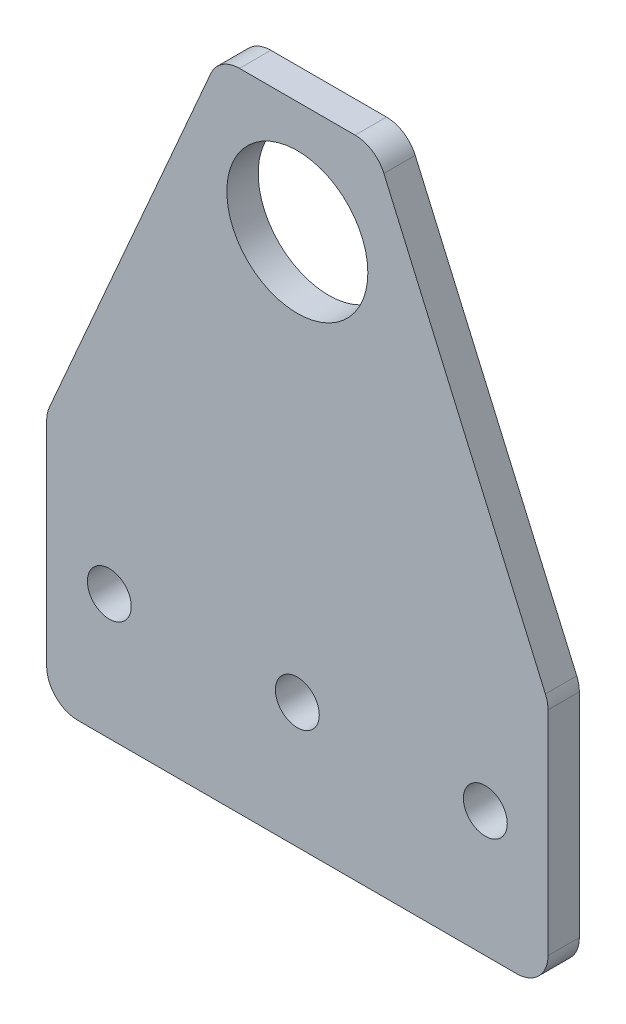
ISO-10303-21;
HEADER;
FILE_DESCRIPTION(('STEP AP214'),'2;1');
FILE_NAME('part.step','',(''),(''),'','','');
FILE_SCHEMA(('AUTOMOTIVE_DESIGN { 1 0 10303 214 1 1 1 1 }'));
ENDSEC;
DATA;
#1=APPLICATION_CONTEXT('core data for automotive mechanical design processes');
#2=APPLICATION_PROTOCOL_DEFINITION('international standard','automotive_design',2000,#1);
#3=PRODUCT_CONTEXT('',#1,'mechanical');
#4=PRODUCT('Part','Part','',(#3));
#5=PRODUCT_RELATED_PRODUCT_CATEGORY('part','',(#4));
#6=PRODUCT_DEFINITION_FORMATION('','',#4);
#7=PRODUCT_DEFINITION_CONTEXT('part definition',#1,'design');
#8=PRODUCT_DEFINITION('design','',#6,#7);
#9=PRODUCT_DEFINITION_SHAPE('','',#8);
#10=(LENGTH_UNIT() NAMED_UNIT(*) SI_UNIT(.MILLI.,.METRE.));
#11=(NAMED_UNIT(*) PLANE_ANGLE_UNIT() SI_UNIT($,.RADIAN.));
#12=(NAMED_UNIT(*) SI_UNIT($,.STERADIAN.) SOLID_ANGLE_UNIT());
#13=UNCERTAINTY_MEASURE_WITH_UNIT(LENGTH_MEASURE(1.E-05),#10,'distance_accuracy_value','');
#14=(GEOMETRIC_REPRESENTATION_CONTEXT(3) GLOBAL_UNCERTAINTY_ASSIGNED_CONTEXT((#13)) GLOBAL_UNIT_ASSIGNED_CONTEXT((#10,
#11,#12)) REPRESENTATION_CONTEXT('',''));
#15=CARTESIAN_POINT('',(0.,0.,0.));
#16=DIRECTION('',(0.,0.,1.));
#17=DIRECTION('',(1.,0.,0.));
#18=AXIS2_PLACEMENT_3D('',#15,#16,#17);
#19=CARTESIAN_POINT('',(0.,0.,5.));
#20=DIRECTION('',(0.,0.,1.));
#21=DIRECTION('',(1.,0.,0.));
#22=AXIS2_PLACEMENT_3D('',#19,#20,#21);
#23=PLANE('',#22);
#24=CARTESIAN_POINT('',(30.,20.,5.));
#25=DIRECTION('',(0.,0.,1.));
#26=DIRECTION('',(1.,0.,0.));
#27=AXIS2_PLACEMENT_3D('',#24,#25,#26);
#28=CIRCLE('',#27,3.5);
#29=CARTESIAN_POINT('',(33.5,20.,5.));
#30=VERTEX_POINT('',#29);
#31=EDGE_CURVE('E237',#30,#30,#28,.T.);
#32=ORIENTED_EDGE('',*,*,#31,.F.);
#33=EDGE_LOOP('',(#32));
#34=FACE_BOUND('',#33,.T.);
#35=CARTESIAN_POINT('',(0.,85.,5.));
#36=DIRECTION('',(0.,0.,1.));
#37=DIRECTION('',(1.,0.,0.));
#38=AXIS2_PLACEMENT_3D('',#35,#36,#37);
#39=CIRCLE('',#38,11.25);
#40=CARTESIAN_POINT('',(11.25,85.,5.));
#41=VERTEX_POINT('',#40);
#42=EDGE_CURVE('E218',#41,#41,#39,.T.);
#43=ORIENTED_EDGE('',*,*,#42,.F.);
#44=EDGE_LOOP('',(#43));
#45=FACE_BOUND('',#44,.T.);
#46=DIRECTION('',(-0.400055548759183,0.916490893521037,0.));
#47=VECTOR('',#46,1.);
#48=CARTESIAN_POINT('',(40.,40.,5.));
#49=LINE('',#48,#47);
#50=CARTESIAN_POINT('',(39.5824544676052,40.9565588560318,5.));
#51=VERTEX_POINT('',#50);
#52=CARTESIAN_POINT('',(13.8094025721526,100.000277743796,5.));
#53=VERTEX_POINT('',#52);
#54=EDGE_CURVE('E220',#51,#53,#49,.T.);
#55=ORIENTED_EDGE('',*,*,#54,.T.);
#56=CARTESIAN_POINT('',(9.22694810454739,98.,5.));
#57=DIRECTION('',(0.,0.,1.));
#58=DIRECTION('',(1.,0.,0.));
#59=AXIS2_PLACEMENT_3D('',#56,#57,#58);
#60=CIRCLE('',#59,5.);
#61=CARTESIAN_POINT('',(9.22694810454739,103.,5.));
#62=VERTEX_POINT('',#61);
#63=EDGE_CURVE('E181',#53,#62,#60,.T.);
#64=ORIENTED_EDGE('',*,*,#63,.T.);
#65=DIRECTION('',(-1.,0.,0.));
#66=VECTOR('',#65,1.);
#67=CARTESIAN_POINT('',(12.5,103.,5.));
#68=LINE('',#67,#66);
#69=CARTESIAN_POINT('',(-9.2269481045474,103.,5.));
#70=VERTEX_POINT('',#69);
#71=EDGE_CURVE('E143',#62,#70,#68,.T.);
#72=ORIENTED_EDGE('',*,*,#71,.T.);
#73=CARTESIAN_POINT('',(-9.2269481045474,98.,5.));
#74=DIRECTION('',(0.,0.,1.));
#75=DIRECTION('',(1.,0.,0.));
#76=AXIS2_PLACEMENT_3D('',#73,#74,#75);
#77=CIRCLE('',#76,5.);
#78=CARTESIAN_POINT('',(-13.8094025721526,100.000277743796,5.));
#79=VERTEX_POINT('',#78);
#80=EDGE_CURVE('E179',#70,#79,#77,.T.);
#81=ORIENTED_EDGE('',*,*,#80,.T.);
#82=DIRECTION('',(-0.400055548759183,-0.916490893521037,0.));
#83=VECTOR('',#82,1.);
#84=CARTESIAN_POINT('',(-40.,40.,5.));
#85=LINE('',#84,#83);
#86=CARTESIAN_POINT('',(-39.5824544676052,40.9565588560318,5.));
#87=VERTEX_POINT('',#86);
#88=EDGE_CURVE('E150',#79,#87,#85,.T.);
#89=ORIENTED_EDGE('',*,*,#88,.T.);
#90=CARTESIAN_POINT('',(-35.,38.9562811122358,5.));
#91=DIRECTION('',(0.,0.,1.));
#92=DIRECTION('',(1.,0.,0.));
#93=AXIS2_PLACEMENT_3D('',#90,#91,#92);
#94=CIRCLE('',#93,5.);
#95=CARTESIAN_POINT('',(-40.,38.9562811122358,5.));
#96=VERTEX_POINT('',#95);
#97=EDGE_CURVE('E177',#87,#96,#94,.T.);
#98=ORIENTED_EDGE('',*,*,#97,.T.);
#99=DIRECTION('',(0.,-1.,0.));
#100=VECTOR('',#99,1.);
#101=CARTESIAN_POINT('',(-40.,0.,5.));
#102=LINE('',#101,#100);
#103=CARTESIAN_POINT('',(-40.,5.,5.));
#104=VERTEX_POINT('',#103);
#105=EDGE_CURVE('E154',#96,#104,#102,.T.);
#106=ORIENTED_EDGE('',*,*,#105,.T.);
#107=CARTESIAN_POINT('',(-35.,5.,5.));
#108=DIRECTION('',(0.,0.,1.));
#109=DIRECTION('',(1.,0.,0.));
#110=AXIS2_PLACEMENT_3D('',#107,#108,#109);
#111=CIRCLE('',#110,5.);
#112=CARTESIAN_POINT('',(-35.,0.,5.));
#113=VERTEX_POINT('',#112);
#114=EDGE_CURVE('E172',#104,#113,#111,.T.);
#115=ORIENTED_EDGE('',*,*,#114,.T.);
#116=DIRECTION('',(1.,0.,0.));
#117=VECTOR('',#116,1.);
#118=CARTESIAN_POINT('',(-40.,0.,5.));
#119=LINE('',#118,#117);
#120=CARTESIAN_POINT('',(35.,0.,5.));
#121=VERTEX_POINT('',#120);
#122=EDGE_CURVE('E205',#113,#121,#119,.T.);
#123=ORIENTED_EDGE('',*,*,#122,.T.);
#124=CARTESIAN_POINT('',(35.,5.,5.));
#125=DIRECTION('',(0.,0.,1.));
#126=DIRECTION('',(1.,0.,0.));
#127=AXIS2_PLACEMENT_3D('',#124,#125,#126);
#128=CIRCLE('',#127,5.);
#129=CARTESIAN_POINT('',(40.,5.,5.));
#130=VERTEX_POINT('',#129);
#131=EDGE_CURVE('E55',#121,#130,#128,.T.);
#132=ORIENTED_EDGE('',*,*,#131,.T.);
#133=DIRECTION('',(0.,1.,0.));
#134=VECTOR('',#133,1.);
#135=CARTESIAN_POINT('',(40.,0.,5.));
#136=LINE('',#135,#134);
#137=CARTESIAN_POINT('',(40.,38.9562811122358,5.));
#138=VERTEX_POINT('',#137);
#139=EDGE_CURVE('E223',#130,#138,#136,.T.);
#140=ORIENTED_EDGE('',*,*,#139,.T.);
#141=CARTESIAN_POINT('',(35.,38.9562811122358,5.));
#142=DIRECTION('',(0.,0.,1.));
#143=DIRECTION('',(1.,0.,0.));
#144=AXIS2_PLACEMENT_3D('',#141,#142,#143);
#145=CIRCLE('',#144,5.);
#146=EDGE_CURVE('E175',#138,#51,#145,.T.);
#147=ORIENTED_EDGE('',*,*,#146,.T.);
#148=EDGE_LOOP('',(#55,#64,#72,#81,#89,#98,#106,#115,#123,#132,#140,#147));
#149=FACE_BOUND('',#148,.T.);
#150=CARTESIAN_POINT('',(0.,20.,5.));
#151=DIRECTION('',(0.,0.,1.));
#152=DIRECTION('',(1.,0.,0.));
#153=AXIS2_PLACEMENT_3D('',#150,#151,#152);
#154=CIRCLE('',#153,3.5);
#155=CARTESIAN_POINT('',(3.5,20.,5.));
#156=VERTEX_POINT('',#155);
#157=EDGE_CURVE('E231',#156,#156,#154,.T.);
#158=ORIENTED_EDGE('',*,*,#157,.F.);
#159=EDGE_LOOP('',(#158));
#160=FACE_BOUND('',#159,.T.);
#161=CARTESIAN_POINT('',(-30.,20.,5.));
#162=DIRECTION('',(0.,0.,1.));
#163=DIRECTION('',(-1.,0.,0.));
#164=AXIS2_PLACEMENT_3D('',#161,#162,#163);
#165=CIRCLE('',#164,3.5);
#166=CARTESIAN_POINT('',(-33.5,20.,5.));
#167=VERTEX_POINT('',#166);
#168=EDGE_CURVE('E243',#167,#167,#165,.T.);
#169=ORIENTED_EDGE('',*,*,#168,.F.);
#170=EDGE_LOOP('',(#169));
#171=FACE_BOUND('',#170,.T.);
#172=ADVANCED_FACE('F33',(#34,#45,#149,#160,#171),#23,.T.);
#173=CARTESIAN_POINT('',(0.,0.,0.));
#174=DIRECTION('',(0.,0.,1.));
#175=DIRECTION('',(1.,0.,0.));
#176=AXIS2_PLACEMENT_3D('',#173,#174,#175);
#177=PLANE('',#176);
#178=DIRECTION('',(-1.,0.,0.));
#179=VECTOR('',#178,1.);
#180=CARTESIAN_POINT('',(12.5,103.,0.));
#181=LINE('',#180,#179);
#182=CARTESIAN_POINT('',(9.22694810454739,103.,0.));
#183=VERTEX_POINT('',#182);
#184=CARTESIAN_POINT('',(-9.2269481045474,103.,0.));
#185=VERTEX_POINT('',#184);
#186=EDGE_CURVE('E140',#183,#185,#181,.T.);
#187=ORIENTED_EDGE('',*,*,#186,.F.);
#188=CARTESIAN_POINT('',(9.22694810454739,98.,0.));
#189=DIRECTION('',(0.,0.,1.));
#190=DIRECTION('',(1.,0.,0.));
#191=AXIS2_PLACEMENT_3D('',#188,#189,#190);
#192=CIRCLE('',#191,5.);
#193=CARTESIAN_POINT('',(13.8094025721526,100.000277743796,0.));
#194=VERTEX_POINT('',#193);
#195=EDGE_CURVE('E123',#183,#194,#192,.F.);
#196=ORIENTED_EDGE('',*,*,#195,.T.);
#197=DIRECTION('',(-0.400055548759183,0.916490893521037,0.));
#198=VECTOR('',#197,1.);
#199=CARTESIAN_POINT('',(40.,40.,0.));
#200=LINE('',#199,#198);
#201=CARTESIAN_POINT('',(39.5824544676052,40.9565588560318,0.));
#202=VERTEX_POINT('',#201);
#203=EDGE_CURVE('E151',#202,#194,#200,.T.);
#204=ORIENTED_EDGE('',*,*,#203,.F.);
#205=CARTESIAN_POINT('',(35.,38.9562811122358,0.));
#206=DIRECTION('',(0.,0.,1.));
#207=DIRECTION('',(1.,0.,0.));
#208=AXIS2_PLACEMENT_3D('',#205,#206,#207);
#209=CIRCLE('',#208,5.);
#210=CARTESIAN_POINT('',(40.,38.9562811122358,0.));
#211=VERTEX_POINT('',#210);
#212=EDGE_CURVE('E164',#202,#211,#209,.F.);
#213=ORIENTED_EDGE('',*,*,#212,.T.);
#214=DIRECTION('',(0.,1.,0.));
#215=VECTOR('',#214,1.);
#216=CARTESIAN_POINT('',(40.,0.,0.));
#217=LINE('',#216,#215);
#218=CARTESIAN_POINT('',(40.,5.,0.));
#219=VERTEX_POINT('',#218);
#220=EDGE_CURVE('E156',#219,#211,#217,.T.);
#221=ORIENTED_EDGE('',*,*,#220,.F.);
#222=CARTESIAN_POINT('',(35.,5.,0.));
#223=DIRECTION('',(0.,0.,1.));
#224=DIRECTION('',(1.,0.,0.));
#225=AXIS2_PLACEMENT_3D('',#222,#223,#224);
#226=CIRCLE('',#225,5.);
#227=CARTESIAN_POINT('',(35.,0.,0.));
#228=VERTEX_POINT('',#227);
#229=EDGE_CURVE('E162',#219,#228,#226,.F.);
#230=ORIENTED_EDGE('',*,*,#229,.T.);
#231=DIRECTION('',(1.,0.,0.));
#232=VECTOR('',#231,1.);
#233=CARTESIAN_POINT('',(-40.,0.,0.));
#234=LINE('',#233,#232);
#235=CARTESIAN_POINT('',(-35.,0.,0.));
#236=VERTEX_POINT('',#235);
#237=EDGE_CURVE('E203',#236,#228,#234,.T.);
#238=ORIENTED_EDGE('',*,*,#237,.F.);
#239=CARTESIAN_POINT('',(-35.,5.,0.));
#240=DIRECTION('',(0.,0.,1.));
#241=DIRECTION('',(1.,0.,0.));
#242=AXIS2_PLACEMENT_3D('',#239,#240,#241);
#243=CIRCLE('',#242,5.);
#244=CARTESIAN_POINT('',(-40.,5.,0.));
#245=VERTEX_POINT('',#244);
#246=EDGE_CURVE('E144',#236,#245,#243,.F.);
#247=ORIENTED_EDGE('',*,*,#246,.T.);
#248=DIRECTION('',(0.,-1.,0.));
#249=VECTOR('',#248,1.);
#250=CARTESIAN_POINT('',(-40.,0.,0.));
#251=LINE('',#250,#249);
#252=CARTESIAN_POINT('',(-40.,38.9562811122358,0.));
#253=VERTEX_POINT('',#252);
#254=EDGE_CURVE('E211',#253,#245,#251,.T.);
#255=ORIENTED_EDGE('',*,*,#254,.F.);
#256=CARTESIAN_POINT('',(-35.,38.9562811122358,0.));
#257=DIRECTION('',(0.,0.,1.));
#258=DIRECTION('',(1.,0.,0.));
#259=AXIS2_PLACEMENT_3D('',#256,#257,#258);
#260=CIRCLE('',#259,5.);
#261=CARTESIAN_POINT('',(-39.5824544676052,40.9565588560318,0.));
#262=VERTEX_POINT('',#261);
#263=EDGE_CURVE('E166',#253,#262,#260,.F.);
#264=ORIENTED_EDGE('',*,*,#263,.T.);
#265=DIRECTION('',(-0.400055548759183,-0.916490893521037,0.));
#266=VECTOR('',#265,1.);
#267=CARTESIAN_POINT('',(-40.,40.,0.));
#268=LINE('',#267,#266);
#269=CARTESIAN_POINT('',(-13.8094025721526,100.000277743796,0.));
#270=VERTEX_POINT('',#269);
#271=EDGE_CURVE('E213',#270,#262,#268,.T.);
#272=ORIENTED_EDGE('',*,*,#271,.F.);
#273=CARTESIAN_POINT('',(-9.2269481045474,98.,0.));
#274=DIRECTION('',(0.,0.,1.));
#275=DIRECTION('',(1.,0.,0.));
#276=AXIS2_PLACEMENT_3D('',#273,#274,#275);
#277=CIRCLE('',#276,5.);
#278=EDGE_CURVE('E134',#270,#185,#277,.F.);
#279=ORIENTED_EDGE('',*,*,#278,.T.);
#280=EDGE_LOOP('',(#187,#196,#204,#213,#221,#230,#238,#247,#255,#264,#272,#279));
#281=FACE_BOUND('',#280,.T.);
#282=CARTESIAN_POINT('',(0.,85.,0.));
#283=DIRECTION('',(0.,0.,1.));
#284=DIRECTION('',(1.,0.,0.));
#285=AXIS2_PLACEMENT_3D('',#282,#283,#284);
#286=CIRCLE('',#285,11.25);
#287=CARTESIAN_POINT('',(11.25,85.,0.));
#288=VERTEX_POINT('',#287);
#289=EDGE_CURVE('E228',#288,#288,#286,.T.);
#290=ORIENTED_EDGE('',*,*,#289,.T.);
#291=EDGE_LOOP('',(#290));
#292=FACE_BOUND('',#291,.T.);
#293=CARTESIAN_POINT('',(0.,20.,0.));
#294=DIRECTION('',(0.,0.,1.));
#295=DIRECTION('',(1.,0.,0.));
#296=AXIS2_PLACEMENT_3D('',#293,#294,#295);
#297=CIRCLE('',#296,3.5);
#298=CARTESIAN_POINT('',(3.5,20.,0.));
#299=VERTEX_POINT('',#298);
#300=EDGE_CURVE('E234',#299,#299,#297,.T.);
#301=ORIENTED_EDGE('',*,*,#300,.T.);
#302=EDGE_LOOP('',(#301));
#303=FACE_BOUND('',#302,.T.);
#304=CARTESIAN_POINT('',(30.,20.,0.));
#305=DIRECTION('',(0.,0.,1.));
#306=DIRECTION('',(1.,0.,0.));
#307=AXIS2_PLACEMENT_3D('',#304,#305,#306);
#308=CIRCLE('',#307,3.5);
#309=CARTESIAN_POINT('',(33.5,20.,0.));
#310=VERTEX_POINT('',#309);
#311=EDGE_CURVE('E240',#310,#310,#308,.T.);
#312=ORIENTED_EDGE('',*,*,#311,.T.);
#313=EDGE_LOOP('',(#312));
#314=FACE_BOUND('',#313,.T.);
#315=CARTESIAN_POINT('',(-30.,20.,0.));
#316=DIRECTION('',(0.,0.,1.));
#317=DIRECTION('',(-1.,0.,0.));
#318=AXIS2_PLACEMENT_3D('',#315,#316,#317);
#319=CIRCLE('',#318,3.5);
#320=CARTESIAN_POINT('',(-33.5,20.,0.));
#321=VERTEX_POINT('',#320);
#322=EDGE_CURVE('E246',#321,#321,#319,.T.);
#323=ORIENTED_EDGE('',*,*,#322,.T.);
#324=EDGE_LOOP('',(#323));
#325=FACE_BOUND('',#324,.T.);
#326=ADVANCED_FACE('F147',(#281,#292,#303,#314,#325),#177,.F.);
#327=CARTESIAN_POINT('',(-40.,40.,5.));
#328=DIRECTION('',(0.916490893521037,-0.400055548759183,0.));
#329=DIRECTION('',(0.400055548759183,0.916490893521037,0.));
#330=AXIS2_PLACEMENT_3D('',#327,#328,#329);
#331=PLANE('',#330);
#332=ORIENTED_EDGE('',*,*,#88,.F.);
#333=DIRECTION('',(0.,0.,-1.));
#334=VECTOR('',#333,1.);
#335=CARTESIAN_POINT('',(-13.8094025721526,100.000277743796,5.));
#336=LINE('',#335,#334);
#337=EDGE_CURVE('E185',#79,#270,#336,.T.);
#338=ORIENTED_EDGE('',*,*,#337,.T.);
#339=ORIENTED_EDGE('',*,*,#271,.T.);
#340=DIRECTION('',(0.,0.,-1.));
#341=VECTOR('',#340,1.);
#342=CARTESIAN_POINT('',(-39.5824544676052,40.9565588560318,5.));
#343=LINE('',#342,#341);
#344=EDGE_CURVE('E183',#262,#87,#343,.F.);
#345=ORIENTED_EDGE('',*,*,#344,.T.);
#346=EDGE_LOOP('',(#332,#338,#339,#345));
#347=FACE_BOUND('',#346,.T.);
#348=ADVANCED_FACE('F261',(#347),#331,.F.);
#349=CARTESIAN_POINT('',(-40.,0.,5.));
#350=DIRECTION('',(1.,0.,0.));
#351=DIRECTION('',(0.,0.,-1.));
#352=AXIS2_PLACEMENT_3D('',#349,#350,#351);
#353=PLANE('',#352);
#354=ORIENTED_EDGE('',*,*,#105,.F.);
#355=DIRECTION('',(0.,0.,-1.));
#356=VECTOR('',#355,1.);
#357=CARTESIAN_POINT('',(-40.,38.9562811122358,5.));
#358=LINE('',#357,#356);
#359=EDGE_CURVE('E190',#96,#253,#358,.T.);
#360=ORIENTED_EDGE('',*,*,#359,.T.);
#361=ORIENTED_EDGE('',*,*,#254,.T.);
#362=DIRECTION('',(0.,0.,-1.));
#363=VECTOR('',#362,1.);
#364=CARTESIAN_POINT('',(-40.,5.,5.));
#365=LINE('',#364,#363);
#366=EDGE_CURVE('E188',#245,#104,#365,.F.);
#367=ORIENTED_EDGE('',*,*,#366,.T.);
#368=EDGE_LOOP('',(#354,#360,#361,#367));
#369=FACE_BOUND('',#368,.T.);
#370=ADVANCED_FACE('F280',(#369),#353,.F.);
#371=CARTESIAN_POINT('',(-40.,0.,5.));
#372=DIRECTION('',(0.,1.,0.));
#373=DIRECTION('',(0.,0.,1.));
#374=AXIS2_PLACEMENT_3D('',#371,#372,#373);
#375=PLANE('',#374);
#376=ORIENTED_EDGE('',*,*,#237,.T.);
#377=DIRECTION('',(0.,0.,-1.));
#378=VECTOR('',#377,1.);
#379=CARTESIAN_POINT('',(35.,0.,5.));
#380=LINE('',#379,#378);
#381=EDGE_CURVE('E11',#228,#121,#380,.F.);
#382=ORIENTED_EDGE('',*,*,#381,.T.);
#383=ORIENTED_EDGE('',*,*,#122,.F.);
#384=DIRECTION('',(0.,0.,-1.));
#385=VECTOR('',#384,1.);
#386=CARTESIAN_POINT('',(-35.,0.,5.));
#387=LINE('',#386,#385);
#388=EDGE_CURVE('E41',#113,#236,#387,.T.);
#389=ORIENTED_EDGE('',*,*,#388,.T.);
#390=EDGE_LOOP('',(#376,#382,#383,#389));
#391=FACE_BOUND('',#390,.T.);
#392=ADVANCED_FACE('F202',(#391),#375,.F.);
#393=CARTESIAN_POINT('',(40.,0.,5.));
#394=DIRECTION('',(-1.,0.,0.));
#395=DIRECTION('',(0.,0.,1.));
#396=AXIS2_PLACEMENT_3D('',#393,#394,#395);
#397=PLANE('',#396);
#398=ORIENTED_EDGE('',*,*,#220,.T.);
#399=DIRECTION('',(0.,0.,-1.));
#400=VECTOR('',#399,1.);
#401=CARTESIAN_POINT('',(40.,38.9562811122358,5.));
#402=LINE('',#401,#400);
#403=EDGE_CURVE('E48',#211,#138,#402,.F.);
#404=ORIENTED_EDGE('',*,*,#403,.T.);
#405=ORIENTED_EDGE('',*,*,#139,.F.);
#406=DIRECTION('',(0.,0.,-1.));
#407=VECTOR('',#406,1.);
#408=CARTESIAN_POINT('',(40.,5.,5.));
#409=LINE('',#408,#407);
#410=EDGE_CURVE('E193',#130,#219,#409,.T.);
#411=ORIENTED_EDGE('',*,*,#410,.T.);
#412=EDGE_LOOP('',(#398,#404,#405,#411));
#413=FACE_BOUND('',#412,.T.);
#414=ADVANCED_FACE('F274',(#413),#397,.F.);
#415=CARTESIAN_POINT('',(40.,40.,5.));
#416=DIRECTION('',(-0.916490893521037,-0.400055548759183,0.));
#417=DIRECTION('',(0.400055548759183,-0.916490893521037,0.));
#418=AXIS2_PLACEMENT_3D('',#415,#416,#417);
#419=PLANE('',#418);
#420=ORIENTED_EDGE('',*,*,#203,.T.);
#421=DIRECTION('',(0.,0.,-1.));
#422=VECTOR('',#421,1.);
#423=CARTESIAN_POINT('',(13.8094025721526,100.000277743796,5.));
#424=LINE('',#423,#422);
#425=EDGE_CURVE('E128',#194,#53,#424,.F.);
#426=ORIENTED_EDGE('',*,*,#425,.T.);
#427=ORIENTED_EDGE('',*,*,#54,.F.);
#428=DIRECTION('',(0.,0.,-1.));
#429=VECTOR('',#428,1.);
#430=CARTESIAN_POINT('',(39.5824544676052,40.9565588560318,5.));
#431=LINE('',#430,#429);
#432=EDGE_CURVE('E133',#51,#202,#431,.T.);
#433=ORIENTED_EDGE('',*,*,#432,.T.);
#434=EDGE_LOOP('',(#420,#426,#427,#433));
#435=FACE_BOUND('',#434,.T.);
#436=ADVANCED_FACE('F271',(#435),#419,.F.);
#437=CARTESIAN_POINT('',(12.5,103.,5.));
#438=DIRECTION('',(0.,-1.,0.));
#439=DIRECTION('',(0.,0.,-1.));
#440=AXIS2_PLACEMENT_3D('',#437,#438,#439);
#441=PLANE('',#440);
#442=ORIENTED_EDGE('',*,*,#71,.F.);
#443=DIRECTION('',(0.,0.,-1.));
#444=VECTOR('',#443,1.);
#445=CARTESIAN_POINT('',(9.22694810454739,103.,5.));
#446=LINE('',#445,#444);
#447=EDGE_CURVE('E127',#62,#183,#446,.T.);
#448=ORIENTED_EDGE('',*,*,#447,.T.);
#449=ORIENTED_EDGE('',*,*,#186,.T.);
#450=DIRECTION('',(0.,0.,-1.));
#451=VECTOR('',#450,1.);
#452=CARTESIAN_POINT('',(-9.2269481045474,103.,5.));
#453=LINE('',#452,#451);
#454=EDGE_CURVE('E145',#185,#70,#453,.F.);
#455=ORIENTED_EDGE('',*,*,#454,.T.);
#456=EDGE_LOOP('',(#442,#448,#449,#455));
#457=FACE_BOUND('',#456,.T.);
#458=ADVANCED_FACE('F139',(#457),#441,.F.);
#459=CARTESIAN_POINT('',(0.,85.,5.));
#460=DIRECTION('',(0.,0.,-1.));
#461=DIRECTION('',(-1.,0.,0.));
#462=AXIS2_PLACEMENT_3D('',#459,#460,#461);
#463=CYLINDRICAL_SURFACE('',#462,11.25);
#464=ORIENTED_EDGE('',*,*,#42,.T.);
#465=EDGE_LOOP('',(#464));
#466=FACE_BOUND('',#465,.T.);
#467=ORIENTED_EDGE('',*,*,#289,.F.);
#468=EDGE_LOOP('',(#467));
#469=FACE_BOUND('',#468,.T.);
#470=ADVANCED_FACE('F266',(#466,#469),#463,.F.);
#471=CARTESIAN_POINT('',(0.,20.,5.));
#472=DIRECTION('',(0.,0.,-1.));
#473=DIRECTION('',(-1.,0.,0.));
#474=AXIS2_PLACEMENT_3D('',#471,#472,#473);
#475=CYLINDRICAL_SURFACE('',#474,3.5);
#476=ORIENTED_EDGE('',*,*,#157,.T.);
#477=EDGE_LOOP('',(#476));
#478=FACE_BOUND('',#477,.T.);
#479=ORIENTED_EDGE('',*,*,#300,.F.);
#480=EDGE_LOOP('',(#479));
#481=FACE_BOUND('',#480,.T.);
#482=ADVANCED_FACE('F321',(#478,#481),#475,.F.);
#483=CARTESIAN_POINT('',(30.,20.,5.));
#484=DIRECTION('',(0.,0.,-1.));
#485=DIRECTION('',(-1.,0.,0.));
#486=AXIS2_PLACEMENT_3D('',#483,#484,#485);
#487=CYLINDRICAL_SURFACE('',#486,3.5);
#488=ORIENTED_EDGE('',*,*,#31,.T.);
#489=EDGE_LOOP('',(#488));
#490=FACE_BOUND('',#489,.T.);
#491=ORIENTED_EDGE('',*,*,#311,.F.);
#492=EDGE_LOOP('',(#491));
#493=FACE_BOUND('',#492,.T.);
#494=ADVANCED_FACE('F324',(#490,#493),#487,.F.);
#495=CARTESIAN_POINT('',(-30.,20.,5.));
#496=DIRECTION('',(0.,0.,-1.));
#497=DIRECTION('',(-1.,0.,0.));
#498=AXIS2_PLACEMENT_3D('',#495,#496,#497);
#499=CYLINDRICAL_SURFACE('',#498,3.5);
#500=ORIENTED_EDGE('',*,*,#168,.T.);
#501=EDGE_LOOP('',(#500));
#502=FACE_BOUND('',#501,.T.);
#503=ORIENTED_EDGE('',*,*,#322,.F.);
#504=EDGE_LOOP('',(#503));
#505=FACE_BOUND('',#504,.T.);
#506=ADVANCED_FACE('F252',(#502,#505),#499,.F.);
#507=CARTESIAN_POINT('',(9.22694810454739,98.,5.));
#508=DIRECTION('',(0.,0.,-1.));
#509=DIRECTION('',(-1.,0.,0.));
#510=AXIS2_PLACEMENT_3D('',#507,#508,#509);
#511=CYLINDRICAL_SURFACE('',#510,5.);
#512=ORIENTED_EDGE('',*,*,#63,.F.);
#513=ORIENTED_EDGE('',*,*,#425,.F.);
#514=ORIENTED_EDGE('',*,*,#195,.F.);
#515=ORIENTED_EDGE('',*,*,#447,.F.);
#516=EDGE_LOOP('',(#512,#513,#514,#515));
#517=FACE_BOUND('',#516,.T.);
#518=ADVANCED_FACE('F126',(#517),#511,.T.);
#519=CARTESIAN_POINT('',(-9.2269481045474,98.,5.));
#520=DIRECTION('',(0.,0.,-1.));
#521=DIRECTION('',(-1.,0.,0.));
#522=AXIS2_PLACEMENT_3D('',#519,#520,#521);
#523=CYLINDRICAL_SURFACE('',#522,5.);
#524=ORIENTED_EDGE('',*,*,#80,.F.);
#525=ORIENTED_EDGE('',*,*,#454,.F.);
#526=ORIENTED_EDGE('',*,*,#278,.F.);
#527=ORIENTED_EDGE('',*,*,#337,.F.);
#528=EDGE_LOOP('',(#524,#525,#526,#527));
#529=FACE_BOUND('',#528,.T.);
#530=ADVANCED_FACE('F289',(#529),#523,.T.);
#531=CARTESIAN_POINT('',(-35.,38.9562811122358,5.));
#532=DIRECTION('',(0.,0.,-1.));
#533=DIRECTION('',(-1.,0.,0.));
#534=AXIS2_PLACEMENT_3D('',#531,#532,#533);
#535=CYLINDRICAL_SURFACE('',#534,5.);
#536=ORIENTED_EDGE('',*,*,#97,.F.);
#537=ORIENTED_EDGE('',*,*,#344,.F.);
#538=ORIENTED_EDGE('',*,*,#263,.F.);
#539=ORIENTED_EDGE('',*,*,#359,.F.);
#540=EDGE_LOOP('',(#536,#537,#538,#539));
#541=FACE_BOUND('',#540,.T.);
#542=ADVANCED_FACE('F292',(#541),#535,.T.);
#543=CARTESIAN_POINT('',(35.,38.9562811122358,5.));
#544=DIRECTION('',(0.,0.,-1.));
#545=DIRECTION('',(-1.,0.,0.));
#546=AXIS2_PLACEMENT_3D('',#543,#544,#545);
#547=CYLINDRICAL_SURFACE('',#546,5.);
#548=ORIENTED_EDGE('',*,*,#146,.F.);
#549=ORIENTED_EDGE('',*,*,#403,.F.);
#550=ORIENTED_EDGE('',*,*,#212,.F.);
#551=ORIENTED_EDGE('',*,*,#432,.F.);
#552=EDGE_LOOP('',(#548,#549,#550,#551));
#553=FACE_BOUND('',#552,.T.);
#554=ADVANCED_FACE('F296',(#553),#547,.T.);
#555=CARTESIAN_POINT('',(35.,5.,5.));
#556=DIRECTION('',(0.,0.,-1.));
#557=DIRECTION('',(-1.,0.,0.));
#558=AXIS2_PLACEMENT_3D('',#555,#556,#557);
#559=CYLINDRICAL_SURFACE('',#558,5.);
#560=ORIENTED_EDGE('',*,*,#131,.F.);
#561=ORIENTED_EDGE('',*,*,#381,.F.);
#562=ORIENTED_EDGE('',*,*,#229,.F.);
#563=ORIENTED_EDGE('',*,*,#410,.F.);
#564=EDGE_LOOP('',(#560,#561,#562,#563));
#565=FACE_BOUND('',#564,.T.);
#566=ADVANCED_FACE('F299',(#565),#559,.T.);
#567=CARTESIAN_POINT('',(-35.,5.,5.));
#568=DIRECTION('',(0.,0.,-1.));
#569=DIRECTION('',(-1.,0.,0.));
#570=AXIS2_PLACEMENT_3D('',#567,#568,#569);
#571=CYLINDRICAL_SURFACE('',#570,5.);
#572=ORIENTED_EDGE('',*,*,#114,.F.);
#573=ORIENTED_EDGE('',*,*,#366,.F.);
#574=ORIENTED_EDGE('',*,*,#246,.F.);
#575=ORIENTED_EDGE('',*,*,#388,.F.);
#576=EDGE_LOOP('',(#572,#573,#574,#575));
#577=FACE_BOUND('',#576,.T.);
#578=ADVANCED_FACE('F35',(#577),#571,.T.);
#579=CLOSED_SHELL('',(#172,#326,#348,#370,#392,#414,#436,#458,#470,#482,#494,#506,#518,#530,
#542,#554,#566,#578));
#580=MANIFOLD_SOLID_BREP('B2',#579);
#581=ADVANCED_BREP_SHAPE_REPRESENTATION('',(#18,#580),#14);
#582=SHAPE_DEFINITION_REPRESENTATION(#9,#581);
ENDSEC;
END-ISO-10303-21;
